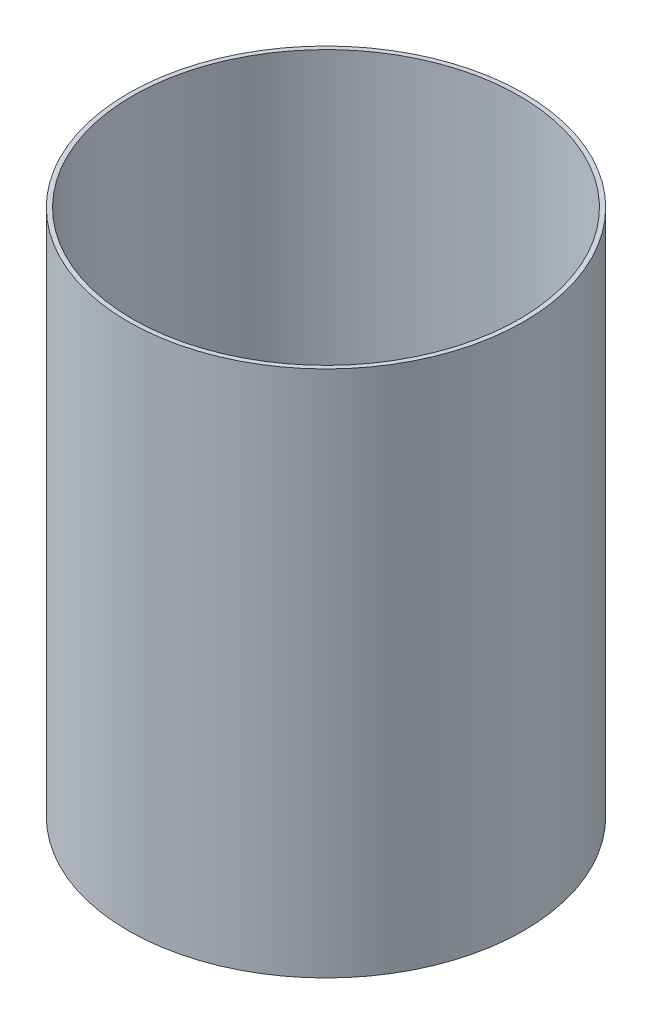
ISO-10303-21;
HEADER;
FILE_DESCRIPTION(('STEP AP214'),'2;1');
FILE_NAME('part.step','',(''),(''),'','','');
FILE_SCHEMA(('AUTOMOTIVE_DESIGN { 1 0 10303 214 1 1 1 1 }'));
ENDSEC;
DATA;
#1=APPLICATION_CONTEXT('core data for automotive mechanical design processes');
#2=APPLICATION_PROTOCOL_DEFINITION('international standard','automotive_design',2000,#1);
#3=PRODUCT_CONTEXT('',#1,'mechanical');
#4=PRODUCT('Part','Part','',(#3));
#5=PRODUCT_RELATED_PRODUCT_CATEGORY('part','',(#4));
#6=PRODUCT_DEFINITION_FORMATION('','',#4);
#7=PRODUCT_DEFINITION_CONTEXT('part definition',#1,'design');
#8=PRODUCT_DEFINITION('design','',#6,#7);
#9=PRODUCT_DEFINITION_SHAPE('','',#8);
#10=(LENGTH_UNIT() NAMED_UNIT(*) SI_UNIT(.MILLI.,.METRE.));
#11=(NAMED_UNIT(*) PLANE_ANGLE_UNIT() SI_UNIT($,.RADIAN.));
#12=(NAMED_UNIT(*) SI_UNIT($,.STERADIAN.) SOLID_ANGLE_UNIT());
#13=UNCERTAINTY_MEASURE_WITH_UNIT(LENGTH_MEASURE(1.E-05),#10,'distance_accuracy_value','');
#14=(GEOMETRIC_REPRESENTATION_CONTEXT(3) GLOBAL_UNCERTAINTY_ASSIGNED_CONTEXT((#13)) GLOBAL_UNIT_ASSIGNED_CONTEXT((#10,
#11,#12)) REPRESENTATION_CONTEXT('',''));
#15=CARTESIAN_POINT('',(0.,0.,0.));
#16=DIRECTION('',(0.,0.,1.));
#17=DIRECTION('',(1.,0.,0.));
#18=AXIS2_PLACEMENT_3D('',#15,#16,#17);
#19=CARTESIAN_POINT('',(0.,600.,0.));
#20=DIRECTION('',(0.,-1.,0.));
#21=DIRECTION('',(0.,0.,-1.));
#22=AXIS2_PLACEMENT_3D('',#19,#20,#21);
#23=CYLINDRICAL_SURFACE('',#22,225.);
#24=CARTESIAN_POINT('',(0.,600.,0.));
#25=DIRECTION('',(0.,1.,0.));
#26=DIRECTION('',(0.,0.,1.));
#27=AXIS2_PLACEMENT_3D('',#24,#25,#26);
#28=CIRCLE('',#27,225.);
#29=CARTESIAN_POINT('',(0.,600.,225.));
#30=VERTEX_POINT('',#29);
#31=EDGE_CURVE('E10',#30,#30,#28,.T.);
#32=ORIENTED_EDGE('',*,*,#31,.F.);
#33=EDGE_LOOP('',(#32));
#34=FACE_BOUND('',#33,.T.);
#35=CARTESIAN_POINT('',(0.,0.,0.));
#36=DIRECTION('',(0.,1.,0.));
#37=DIRECTION('',(0.,0.,1.));
#38=AXIS2_PLACEMENT_3D('',#35,#36,#37);
#39=CIRCLE('',#38,225.);
#40=CARTESIAN_POINT('',(0.,0.,225.));
#41=VERTEX_POINT('',#40);
#42=EDGE_CURVE('E34',#41,#41,#39,.T.);
#43=ORIENTED_EDGE('',*,*,#42,.T.);
#44=EDGE_LOOP('',(#43));
#45=FACE_BOUND('',#44,.T.);
#46=ADVANCED_FACE('F31',(#34,#45),#23,.T.);
#47=CARTESIAN_POINT('',(0.,600.,0.));
#48=DIRECTION('',(0.,1.,0.));
#49=DIRECTION('',(0.,0.,1.));
#50=AXIS2_PLACEMENT_3D('',#47,#48,#49);
#51=PLANE('',#50);
#52=CARTESIAN_POINT('',(0.,600.,0.));
#53=DIRECTION('',(0.,1.,0.));
#54=DIRECTION('',(0.,0.,1.));
#55=AXIS2_PLACEMENT_3D('',#52,#53,#54);
#56=CIRCLE('',#55,220.);
#57=CARTESIAN_POINT('',(0.,600.,220.));
#58=VERTEX_POINT('',#57);
#59=EDGE_CURVE('E41',#58,#58,#56,.T.);
#60=ORIENTED_EDGE('',*,*,#59,.F.);
#61=EDGE_LOOP('',(#60));
#62=FACE_BOUND('',#61,.T.);
#63=ORIENTED_EDGE('',*,*,#31,.T.);
#64=EDGE_LOOP('',(#63));
#65=FACE_BOUND('',#64,.T.);
#66=ADVANCED_FACE('F61',(#62,#65),#51,.T.);
#67=CARTESIAN_POINT('',(0.,0.,0.));
#68=DIRECTION('',(0.,1.,0.));
#69=DIRECTION('',(0.,0.,1.));
#70=AXIS2_PLACEMENT_3D('',#67,#68,#69);
#71=PLANE('',#70);
#72=ORIENTED_EDGE('',*,*,#42,.F.);
#73=EDGE_LOOP('',(#72));
#74=FACE_BOUND('',#73,.T.);
#75=ADVANCED_FACE('F53',(#74),#71,.F.);
#76=CARTESIAN_POINT('',(0.,600.,0.));
#77=DIRECTION('',(0.,-1.,0.));
#78=DIRECTION('',(0.,0.,-1.));
#79=AXIS2_PLACEMENT_3D('',#76,#77,#78);
#80=CYLINDRICAL_SURFACE('',#79,220.);
#81=ORIENTED_EDGE('',*,*,#59,.T.);
#82=EDGE_LOOP('',(#81));
#83=FACE_BOUND('',#82,.T.);
#84=CARTESIAN_POINT('',(0.,5.,0.));
#85=DIRECTION('',(0.,1.,0.));
#86=DIRECTION('',(0.,0.,1.));
#87=AXIS2_PLACEMENT_3D('',#84,#85,#86);
#88=CIRCLE('',#87,220.);
#89=CARTESIAN_POINT('',(0.,5.,220.));
#90=VERTEX_POINT('',#89);
#91=EDGE_CURVE('E45',#90,#90,#88,.T.);
#92=ORIENTED_EDGE('',*,*,#91,.F.);
#93=EDGE_LOOP('',(#92));
#94=FACE_BOUND('',#93,.T.);
#95=ADVANCED_FACE('F51',(#83,#94),#80,.F.);
#96=CARTESIAN_POINT('',(0.,5.,0.));
#97=DIRECTION('',(0.,1.,0.));
#98=DIRECTION('',(0.,0.,1.));
#99=AXIS2_PLACEMENT_3D('',#96,#97,#98);
#100=PLANE('',#99);
#101=ORIENTED_EDGE('',*,*,#91,.T.);
#102=EDGE_LOOP('',(#101));
#103=FACE_BOUND('',#102,.T.);
#104=ADVANCED_FACE('F49',(#103),#100,.T.);
#105=CLOSED_SHELL('',(#46,#66,#75,#95,#104));
#106=MANIFOLD_SOLID_BREP('B2',#105);
#107=ADVANCED_BREP_SHAPE_REPRESENTATION('',(#18,#106),#14);
#108=SHAPE_DEFINITION_REPRESENTATION(#9,#107);
ENDSEC;
END-ISO-10303-21;
